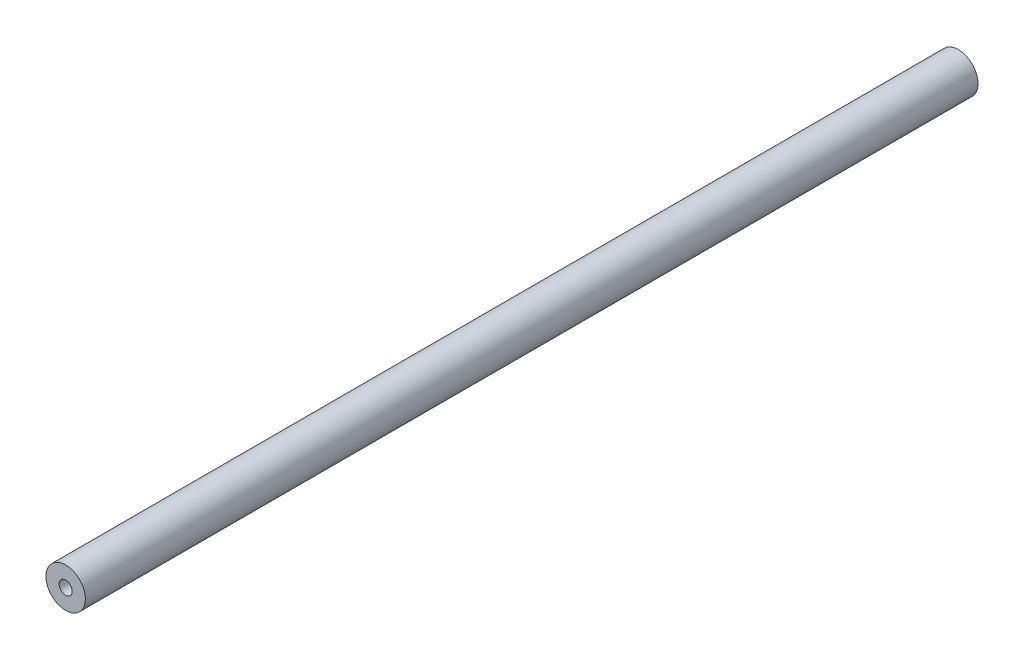
ISO-10303-21;
HEADER;
FILE_DESCRIPTION(('STEP AP214'),'2;1');
FILE_NAME('part.step','',(''),(''),'','','');
FILE_SCHEMA(('AUTOMOTIVE_DESIGN { 1 0 10303 214 1 1 1 1 }'));
ENDSEC;
DATA;
#1=APPLICATION_CONTEXT('core data for automotive mechanical design processes');
#2=APPLICATION_PROTOCOL_DEFINITION('international standard','automotive_design',2000,#1);
#3=PRODUCT_CONTEXT('',#1,'mechanical');
#4=PRODUCT('Part','Part','',(#3));
#5=PRODUCT_RELATED_PRODUCT_CATEGORY('part','',(#4));
#6=PRODUCT_DEFINITION_FORMATION('','',#4);
#7=PRODUCT_DEFINITION_CONTEXT('part definition',#1,'design');
#8=PRODUCT_DEFINITION('design','',#6,#7);
#9=PRODUCT_DEFINITION_SHAPE('','',#8);
#10=(LENGTH_UNIT() NAMED_UNIT(*) SI_UNIT(.MILLI.,.METRE.));
#11=(NAMED_UNIT(*) PLANE_ANGLE_UNIT() SI_UNIT($,.RADIAN.));
#12=(NAMED_UNIT(*) SI_UNIT($,.STERADIAN.) SOLID_ANGLE_UNIT());
#13=UNCERTAINTY_MEASURE_WITH_UNIT(LENGTH_MEASURE(1.E-05),#10,'distance_accuracy_value','');
#14=(GEOMETRIC_REPRESENTATION_CONTEXT(3) GLOBAL_UNCERTAINTY_ASSIGNED_CONTEXT((#13)) GLOBAL_UNIT_ASSIGNED_CONTEXT((#10,
#11,#12)) REPRESENTATION_CONTEXT('',''));
#15=CARTESIAN_POINT('',(0.,0.,0.));
#16=DIRECTION('',(0.,0.,1.));
#17=DIRECTION('',(1.,0.,0.));
#18=AXIS2_PLACEMENT_3D('',#15,#16,#17);
#19=CARTESIAN_POINT('',(0.,0.,215.9));
#20=DIRECTION('',(0.,0.,1.));
#21=DIRECTION('',(1.,0.,0.));
#22=AXIS2_PLACEMENT_3D('',#19,#20,#21);
#23=PLANE('',#22);
#24=CARTESIAN_POINT('',(0.,0.,215.9));
#25=DIRECTION('',(0.,0.,1.));
#26=DIRECTION('',(1.,0.,0.));
#27=AXIS2_PLACEMENT_3D('',#24,#25,#26);
#28=CIRCLE('',#27,4.7625);
#29=CARTESIAN_POINT('',(4.7625,0.,215.9));
#30=VERTEX_POINT('',#29);
#31=EDGE_CURVE('E10',#30,#30,#28,.T.);
#32=ORIENTED_EDGE('',*,*,#31,.T.);
#33=EDGE_LOOP('',(#32));
#34=FACE_BOUND('',#33,.T.);
#35=CARTESIAN_POINT('',(0.,0.,215.9));
#36=DIRECTION('',(0.,0.,1.));
#37=DIRECTION('',(1.,0.,0.));
#38=AXIS2_PLACEMENT_3D('',#35,#36,#37);
#39=CIRCLE('',#38,1.5875);
#40=CARTESIAN_POINT('',(1.5875,0.,215.9));
#41=VERTEX_POINT('',#40);
#42=EDGE_CURVE('E50',#41,#41,#39,.T.);
#43=ORIENTED_EDGE('',*,*,#42,.F.);
#44=EDGE_LOOP('',(#43));
#45=FACE_BOUND('',#44,.T.);
#46=ADVANCED_FACE('F37',(#34,#45),#23,.T.);
#47=CARTESIAN_POINT('',(0.,0.,0.));
#48=DIRECTION('',(0.,0.,1.));
#49=DIRECTION('',(1.,0.,0.));
#50=AXIS2_PLACEMENT_3D('',#47,#48,#49);
#51=PLANE('',#50);
#52=CARTESIAN_POINT('',(0.,0.,0.));
#53=DIRECTION('',(0.,0.,1.));
#54=DIRECTION('',(1.,0.,0.));
#55=AXIS2_PLACEMENT_3D('',#52,#53,#54);
#56=CIRCLE('',#55,4.7625);
#57=CARTESIAN_POINT('',(4.7625,0.,0.));
#58=VERTEX_POINT('',#57);
#59=EDGE_CURVE('E41',#58,#58,#56,.T.);
#60=ORIENTED_EDGE('',*,*,#59,.F.);
#61=EDGE_LOOP('',(#60));
#62=FACE_BOUND('',#61,.T.);
#63=CARTESIAN_POINT('',(0.,0.,0.));
#64=DIRECTION('',(0.,0.,1.));
#65=DIRECTION('',(1.,0.,0.));
#66=AXIS2_PLACEMENT_3D('',#63,#64,#65);
#67=CIRCLE('',#66,1.5875);
#68=CARTESIAN_POINT('',(1.5875,0.,0.));
#69=VERTEX_POINT('',#68);
#70=EDGE_CURVE('E52',#69,#69,#67,.T.);
#71=ORIENTED_EDGE('',*,*,#70,.T.);
#72=EDGE_LOOP('',(#71));
#73=FACE_BOUND('',#72,.T.);
#74=ADVANCED_FACE('F64',(#62,#73),#51,.F.);
#75=CARTESIAN_POINT('',(0.,0.,215.9));
#76=DIRECTION('',(0.,0.,-1.));
#77=DIRECTION('',(-1.,0.,0.));
#78=AXIS2_PLACEMENT_3D('',#75,#76,#77);
#79=CYLINDRICAL_SURFACE('',#78,4.7625);
#80=ORIENTED_EDGE('',*,*,#31,.F.);
#81=EDGE_LOOP('',(#80));
#82=FACE_BOUND('',#81,.T.);
#83=ORIENTED_EDGE('',*,*,#59,.T.);
#84=EDGE_LOOP('',(#83));
#85=FACE_BOUND('',#84,.T.);
#86=ADVANCED_FACE('F39',(#82,#85),#79,.T.);
#87=CARTESIAN_POINT('',(0.,0.,215.9));
#88=DIRECTION('',(0.,0.,-1.));
#89=DIRECTION('',(-1.,0.,0.));
#90=AXIS2_PLACEMENT_3D('',#87,#88,#89);
#91=CYLINDRICAL_SURFACE('',#90,1.5875);
#92=ORIENTED_EDGE('',*,*,#42,.T.);
#93=EDGE_LOOP('',(#92));
#94=FACE_BOUND('',#93,.T.);
#95=ORIENTED_EDGE('',*,*,#70,.F.);
#96=EDGE_LOOP('',(#95));
#97=FACE_BOUND('',#96,.T.);
#98=ADVANCED_FACE('F60',(#94,#97),#91,.F.);
#99=CLOSED_SHELL('',(#46,#74,#86,#98));
#100=MANIFOLD_SOLID_BREP('B2',#99);
#101=ADVANCED_BREP_SHAPE_REPRESENTATION('',(#18,#100),#14);
#102=SHAPE_DEFINITION_REPRESENTATION(#9,#101);
ENDSEC;
END-ISO-10303-21;
